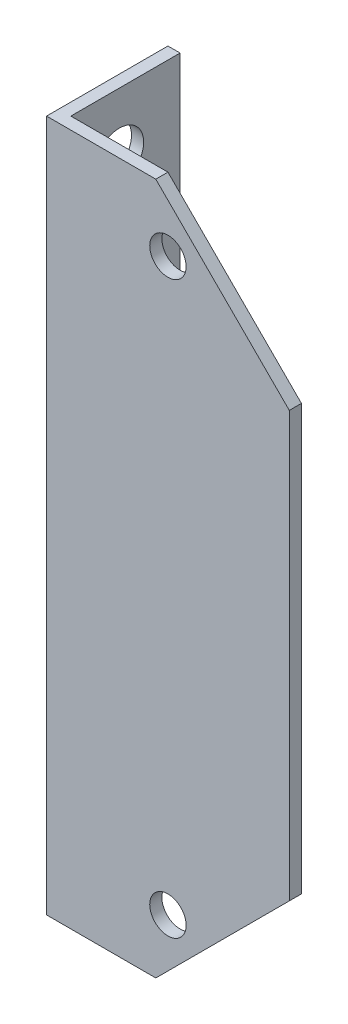
ISO-10303-21;
HEADER;
FILE_DESCRIPTION(('STEP AP214'),'2;1');
FILE_NAME('part.step','',(''),(''),'','','');
FILE_SCHEMA(('AUTOMOTIVE_DESIGN { 1 0 10303 214 1 1 1 1 }'));
ENDSEC;
DATA;
#1=APPLICATION_CONTEXT('core data for automotive mechanical design processes');
#2=APPLICATION_PROTOCOL_DEFINITION('international standard','automotive_design',2000,#1);
#3=PRODUCT_CONTEXT('',#1,'mechanical');
#4=PRODUCT('Part','Part','',(#3));
#5=PRODUCT_RELATED_PRODUCT_CATEGORY('part','',(#4));
#6=PRODUCT_DEFINITION_FORMATION('','',#4);
#7=PRODUCT_DEFINITION_CONTEXT('part definition',#1,'design');
#8=PRODUCT_DEFINITION('design','',#6,#7);
#9=PRODUCT_DEFINITION_SHAPE('','',#8);
#10=(LENGTH_UNIT() NAMED_UNIT(*) SI_UNIT(.MILLI.,.METRE.));
#11=(NAMED_UNIT(*) PLANE_ANGLE_UNIT() SI_UNIT($,.RADIAN.));
#12=(NAMED_UNIT(*) SI_UNIT($,.STERADIAN.) SOLID_ANGLE_UNIT());
#13=UNCERTAINTY_MEASURE_WITH_UNIT(LENGTH_MEASURE(1.E-05),#10,'distance_accuracy_value','');
#14=(GEOMETRIC_REPRESENTATION_CONTEXT(3) GLOBAL_UNCERTAINTY_ASSIGNED_CONTEXT((#13)) GLOBAL_UNIT_ASSIGNED_CONTEXT((#10,
#11,#12)) REPRESENTATION_CONTEXT('',''));
#15=CARTESIAN_POINT('',(0.,0.,0.));
#16=DIRECTION('',(0.,0.,1.));
#17=DIRECTION('',(1.,0.,0.));
#18=AXIS2_PLACEMENT_3D('',#15,#16,#17);
#19=CARTESIAN_POINT('',(-10.,57.,-8.5));
#20=DIRECTION('',(0.,0.,1.));
#21=DIRECTION('',(1.,0.,0.));
#22=AXIS2_PLACEMENT_3D('',#19,#20,#21);
#23=PLANE('',#22);
#24=DIRECTION('',(-1.,0.,0.));
#25=VECTOR('',#24,1.);
#26=CARTESIAN_POINT('',(-10.,0.,-8.5));
#27=LINE('',#26,#25);
#28=CARTESIAN_POINT('',(-10.,0.,-8.5));
#29=VERTEX_POINT('',#28);
#30=CARTESIAN_POINT('',(-11.,0.,-8.5));
#31=VERTEX_POINT('',#30);
#32=EDGE_CURVE('E141',#29,#31,#27,.T.);
#33=ORIENTED_EDGE('',*,*,#32,.T.);
#34=DIRECTION('',(0.,-1.,0.));
#35=VECTOR('',#34,1.);
#36=CARTESIAN_POINT('',(-11.,57.,-8.5));
#37=LINE('',#36,#35);
#38=CARTESIAN_POINT('',(-11.,57.,-8.5));
#39=VERTEX_POINT('',#38);
#40=EDGE_CURVE('E135',#39,#31,#37,.T.);
#41=ORIENTED_EDGE('',*,*,#40,.F.);
#42=DIRECTION('',(-1.,0.,0.));
#43=VECTOR('',#42,1.);
#44=CARTESIAN_POINT('',(-10.,57.,-8.5));
#45=LINE('',#44,#43);
#46=CARTESIAN_POINT('',(-10.,57.,-8.5));
#47=VERTEX_POINT('',#46);
#48=EDGE_CURVE('E116',#47,#39,#45,.T.);
#49=ORIENTED_EDGE('',*,*,#48,.F.);
#50=DIRECTION('',(0.,-1.,0.));
#51=VECTOR('',#50,1.);
#52=CARTESIAN_POINT('',(-10.,57.,-8.5));
#53=LINE('',#52,#51);
#54=EDGE_CURVE('E122',#47,#29,#53,.T.);
#55=ORIENTED_EDGE('',*,*,#54,.T.);
#56=EDGE_LOOP('',(#33,#41,#49,#55));
#57=FACE_BOUND('',#56,.T.);
#58=ADVANCED_FACE('F32',(#57),#23,.F.);
#59=CARTESIAN_POINT('',(-11.,57.,-8.5));
#60=DIRECTION('',(1.,0.,0.));
#61=DIRECTION('',(0.,0.,-1.));
#62=AXIS2_PLACEMENT_3D('',#59,#60,#61);
#63=PLANE('',#62);
#64=CARTESIAN_POINT('',(-11.,5.,-3.5));
#65=DIRECTION('',(-1.,0.,0.));
#66=DIRECTION('',(0.,0.,1.));
#67=AXIS2_PLACEMENT_3D('',#64,#65,#66);
#68=CIRCLE('',#67,2.);
#69=CARTESIAN_POINT('',(-11.,5.,-1.5));
#70=VERTEX_POINT('',#69);
#71=EDGE_CURVE('E145',#70,#70,#68,.T.);
#72=ORIENTED_EDGE('',*,*,#71,.F.);
#73=EDGE_LOOP('',(#72));
#74=FACE_BOUND('',#73,.T.);
#75=CARTESIAN_POINT('',(-11.,52.14,-3.5));
#76=DIRECTION('',(-1.,0.,0.));
#77=DIRECTION('',(0.,0.,1.));
#78=AXIS2_PLACEMENT_3D('',#75,#76,#77);
#79=CIRCLE('',#78,2.);
#80=CARTESIAN_POINT('',(-11.,52.14,-1.5));
#81=VERTEX_POINT('',#80);
#82=EDGE_CURVE('E142',#81,#81,#79,.T.);
#83=ORIENTED_EDGE('',*,*,#82,.F.);
#84=EDGE_LOOP('',(#83));
#85=FACE_BOUND('',#84,.T.);
#86=DIRECTION('',(0.,0.,1.));
#87=VECTOR('',#86,1.);
#88=CARTESIAN_POINT('',(-11.,0.,-8.5));
#89=LINE('',#88,#87);
#90=CARTESIAN_POINT('',(-11.,0.,1.5));
#91=VERTEX_POINT('',#90);
#92=EDGE_CURVE('E118',#31,#91,#89,.T.);
#93=ORIENTED_EDGE('',*,*,#92,.T.);
#94=DIRECTION('',(0.,-1.,0.));
#95=VECTOR('',#94,1.);
#96=CARTESIAN_POINT('',(-11.,57.,1.5));
#97=LINE('',#96,#95);
#98=CARTESIAN_POINT('',(-11.,57.,1.5));
#99=VERTEX_POINT('',#98);
#100=EDGE_CURVE('E132',#99,#91,#97,.T.);
#101=ORIENTED_EDGE('',*,*,#100,.F.);
#102=DIRECTION('',(0.,0.,1.));
#103=VECTOR('',#102,1.);
#104=CARTESIAN_POINT('',(-11.,57.,-8.5));
#105=LINE('',#104,#103);
#106=EDGE_CURVE('E163',#39,#99,#105,.T.);
#107=ORIENTED_EDGE('',*,*,#106,.F.);
#108=ORIENTED_EDGE('',*,*,#40,.T.);
#109=EDGE_LOOP('',(#93,#101,#107,#108));
#110=FACE_BOUND('',#109,.T.);
#111=ADVANCED_FACE('F174',(#74,#85,#110),#63,.F.);
#112=CARTESIAN_POINT('',(-11.,57.,1.5));
#113=DIRECTION('',(0.,0.,-1.));
#114=DIRECTION('',(-1.,0.,0.));
#115=AXIS2_PLACEMENT_3D('',#112,#113,#114);
#116=PLANE('',#115);
#117=CARTESIAN_POINT('',(-0.999999999999996,5.,1.49999999999999));
#118=DIRECTION('',(0.,0.,-1.));
#119=DIRECTION('',(-1.,0.,0.));
#120=AXIS2_PLACEMENT_3D('',#117,#118,#119);
#121=CIRCLE('',#120,1.5);
#122=CARTESIAN_POINT('',(-2.5,5.,1.49999999999999));
#123=VERTEX_POINT('',#122);
#124=EDGE_CURVE('E184',#123,#123,#121,.T.);
#125=ORIENTED_EDGE('',*,*,#124,.T.);
#126=EDGE_LOOP('',(#125));
#127=FACE_BOUND('',#126,.T.);
#128=CARTESIAN_POINT('',(-0.999999999999996,52.,1.49999999999999));
#129=DIRECTION('',(0.,0.,-1.));
#130=DIRECTION('',(-1.,0.,0.));
#131=AXIS2_PLACEMENT_3D('',#128,#129,#130);
#132=CIRCLE('',#131,1.5);
#133=CARTESIAN_POINT('',(-2.5,52.,1.49999999999999));
#134=VERTEX_POINT('',#133);
#135=EDGE_CURVE('E190',#134,#134,#132,.T.);
#136=ORIENTED_EDGE('',*,*,#135,.T.);
#137=EDGE_LOOP('',(#136));
#138=FACE_BOUND('',#137,.T.);
#139=DIRECTION('',(1.,0.,0.));
#140=VECTOR('',#139,1.);
#141=CARTESIAN_POINT('',(-11.,0.,1.5));
#142=LINE('',#141,#140);
#143=CARTESIAN_POINT('',(-2.,0.,1.5));
#144=VERTEX_POINT('',#143);
#145=EDGE_CURVE('E114',#91,#144,#142,.T.);
#146=ORIENTED_EDGE('',*,*,#145,.T.);
#147=DIRECTION('',(0.707106781186548,0.707106781186547,0.));
#148=VECTOR('',#147,1.);
#149=CARTESIAN_POINT('',(22.,24.,1.5));
#150=LINE('',#149,#148);
#151=CARTESIAN_POINT('',(9.00000000000001,11.,1.5));
#152=VERTEX_POINT('',#151);
#153=EDGE_CURVE('E46',#144,#152,#150,.T.);
#154=ORIENTED_EDGE('',*,*,#153,.T.);
#155=DIRECTION('',(0.,-1.,0.));
#156=VECTOR('',#155,1.);
#157=CARTESIAN_POINT('',(9.00000000000001,57.,1.5));
#158=LINE('',#157,#156);
#159=CARTESIAN_POINT('',(9.00000000000001,46.,1.5));
#160=VERTEX_POINT('',#159);
#161=EDGE_CURVE('E129',#160,#152,#158,.T.);
#162=ORIENTED_EDGE('',*,*,#161,.F.);
#163=DIRECTION('',(-0.707106781186547,0.707106781186548,0.));
#164=VECTOR('',#163,1.);
#165=CARTESIAN_POINT('',(-6.49999999999999,61.5,1.5));
#166=LINE('',#165,#164);
#167=CARTESIAN_POINT('',(-1.99999999999999,57.,1.5));
#168=VERTEX_POINT('',#167);
#169=EDGE_CURVE('E148',#160,#168,#166,.T.);
#170=ORIENTED_EDGE('',*,*,#169,.T.);
#171=DIRECTION('',(1.,0.,0.));
#172=VECTOR('',#171,1.);
#173=CARTESIAN_POINT('',(-11.,57.,1.5));
#174=LINE('',#173,#172);
#175=EDGE_CURVE('E157',#99,#168,#174,.T.);
#176=ORIENTED_EDGE('',*,*,#175,.F.);
#177=ORIENTED_EDGE('',*,*,#100,.T.);
#178=EDGE_LOOP('',(#146,#154,#162,#170,#176,#177));
#179=FACE_BOUND('',#178,.T.);
#180=ADVANCED_FACE('F156',(#127,#138,#179),#116,.F.);
#181=CARTESIAN_POINT('',(9.00000000000001,57.,1.5));
#182=DIRECTION('',(-1.,0.,0.));
#183=DIRECTION('',(0.,0.,1.));
#184=AXIS2_PLACEMENT_3D('',#181,#182,#183);
#185=PLANE('',#184);
#186=ORIENTED_EDGE('',*,*,#161,.T.);
#187=DIRECTION('',(0.,0.,-1.));
#188=VECTOR('',#187,1.);
#189=CARTESIAN_POINT('',(9.00000000000001,11.,50.5));
#190=LINE('',#189,#188);
#191=CARTESIAN_POINT('',(9.00000000000001,11.,0.499999999999999));
#192=VERTEX_POINT('',#191);
#193=EDGE_CURVE('E108',#152,#192,#190,.T.);
#194=ORIENTED_EDGE('',*,*,#193,.T.);
#195=DIRECTION('',(0.,-1.,0.));
#196=VECTOR('',#195,1.);
#197=CARTESIAN_POINT('',(9.00000000000001,57.,0.499999999999999));
#198=LINE('',#197,#196);
#199=CARTESIAN_POINT('',(9.00000000000001,46.,0.499999999999999));
#200=VERTEX_POINT('',#199);
#201=EDGE_CURVE('E107',#200,#192,#198,.T.);
#202=ORIENTED_EDGE('',*,*,#201,.F.);
#203=DIRECTION('',(0.,0.,-1.));
#204=VECTOR('',#203,1.);
#205=CARTESIAN_POINT('',(9.00000000000001,46.,50.5));
#206=LINE('',#205,#204);
#207=EDGE_CURVE('E159',#160,#200,#206,.T.);
#208=ORIENTED_EDGE('',*,*,#207,.F.);
#209=EDGE_LOOP('',(#186,#194,#202,#208));
#210=FACE_BOUND('',#209,.T.);
#211=ADVANCED_FACE('F178',(#210),#185,.F.);
#212=CARTESIAN_POINT('',(9.00000000000001,57.,0.499999999999999));
#213=DIRECTION('',(0.,0.,1.));
#214=DIRECTION('',(1.,0.,0.));
#215=AXIS2_PLACEMENT_3D('',#212,#213,#214);
#216=PLANE('',#215);
#217=CARTESIAN_POINT('',(-0.999999999999996,5.,0.5));
#218=DIRECTION('',(0.,0.,-1.));
#219=DIRECTION('',(-1.,0.,0.));
#220=AXIS2_PLACEMENT_3D('',#217,#218,#219);
#221=CIRCLE('',#220,1.5);
#222=CARTESIAN_POINT('',(-2.5,5.,0.5));
#223=VERTEX_POINT('',#222);
#224=EDGE_CURVE('E158',#223,#223,#221,.T.);
#225=ORIENTED_EDGE('',*,*,#224,.F.);
#226=EDGE_LOOP('',(#225));
#227=FACE_BOUND('',#226,.T.);
#228=CARTESIAN_POINT('',(-0.999999999999996,52.,0.5));
#229=DIRECTION('',(0.,0.,-1.));
#230=DIRECTION('',(-1.,0.,0.));
#231=AXIS2_PLACEMENT_3D('',#228,#229,#230);
#232=CIRCLE('',#231,1.5);
#233=CARTESIAN_POINT('',(-2.5,52.,0.5));
#234=VERTEX_POINT('',#233);
#235=EDGE_CURVE('E187',#234,#234,#232,.T.);
#236=ORIENTED_EDGE('',*,*,#235,.F.);
#237=EDGE_LOOP('',(#236));
#238=FACE_BOUND('',#237,.T.);
#239=ORIENTED_EDGE('',*,*,#201,.T.);
#240=DIRECTION('',(0.707106781186548,0.707106781186547,0.));
#241=VECTOR('',#240,1.);
#242=CARTESIAN_POINT('',(9.00000000000001,11.,0.499999999999999));
#243=LINE('',#242,#241);
#244=CARTESIAN_POINT('',(-1.99999999999999,0.,0.5));
#245=VERTEX_POINT('',#244);
#246=EDGE_CURVE('E94',#245,#192,#243,.T.);
#247=ORIENTED_EDGE('',*,*,#246,.F.);
#248=DIRECTION('',(-1.,0.,0.));
#249=VECTOR('',#248,1.);
#250=CARTESIAN_POINT('',(9.00000000000001,0.,0.499999999999999));
#251=LINE('',#250,#249);
#252=CARTESIAN_POINT('',(-10.,0.,0.500000000000001));
#253=VERTEX_POINT('',#252);
#254=EDGE_CURVE('E104',#245,#253,#251,.T.);
#255=ORIENTED_EDGE('',*,*,#254,.T.);
#256=DIRECTION('',(0.,-1.,0.));
#257=VECTOR('',#256,1.);
#258=CARTESIAN_POINT('',(-10.,57.,0.500000000000001));
#259=LINE('',#258,#257);
#260=CARTESIAN_POINT('',(-10.,57.,0.500000000000001));
#261=VERTEX_POINT('',#260);
#262=EDGE_CURVE('E125',#261,#253,#259,.T.);
#263=ORIENTED_EDGE('',*,*,#262,.F.);
#264=DIRECTION('',(-1.,0.,0.));
#265=VECTOR('',#264,1.);
#266=CARTESIAN_POINT('',(9.00000000000001,57.,0.499999999999999));
#267=LINE('',#266,#265);
#268=CARTESIAN_POINT('',(-1.99999999999999,57.,0.5));
#269=VERTEX_POINT('',#268);
#270=EDGE_CURVE('E165',#269,#261,#267,.T.);
#271=ORIENTED_EDGE('',*,*,#270,.F.);
#272=DIRECTION('',(-0.707106781186547,0.707106781186548,0.));
#273=VECTOR('',#272,1.);
#274=CARTESIAN_POINT('',(-1.99999999999999,57.,0.5));
#275=LINE('',#274,#273);
#276=EDGE_CURVE('E53',#200,#269,#275,.T.);
#277=ORIENTED_EDGE('',*,*,#276,.F.);
#278=EDGE_LOOP('',(#239,#247,#255,#263,#271,#277));
#279=FACE_BOUND('',#278,.T.);
#280=ADVANCED_FACE('F102',(#227,#238,#279),#216,.F.);
#281=CARTESIAN_POINT('',(-10.,57.,0.500000000000001));
#282=DIRECTION('',(-1.,0.,0.));
#283=DIRECTION('',(0.,0.,1.));
#284=AXIS2_PLACEMENT_3D('',#281,#282,#283);
#285=PLANE('',#284);
#286=CARTESIAN_POINT('',(-9.99999999999999,5.,-3.5));
#287=DIRECTION('',(-1.,0.,0.));
#288=DIRECTION('',(0.,0.,1.));
#289=AXIS2_PLACEMENT_3D('',#286,#287,#288);
#290=CIRCLE('',#289,2.);
#291=CARTESIAN_POINT('',(-9.99999999999999,5.,-1.5));
#292=VERTEX_POINT('',#291);
#293=EDGE_CURVE('E143',#292,#292,#290,.T.);
#294=ORIENTED_EDGE('',*,*,#293,.T.);
#295=EDGE_LOOP('',(#294));
#296=FACE_BOUND('',#295,.T.);
#297=CARTESIAN_POINT('',(-9.99999999999999,52.14,-3.5));
#298=DIRECTION('',(-1.,0.,0.));
#299=DIRECTION('',(0.,0.,1.));
#300=AXIS2_PLACEMENT_3D('',#297,#298,#299);
#301=CIRCLE('',#300,2.);
#302=CARTESIAN_POINT('',(-9.99999999999999,52.14,-1.5));
#303=VERTEX_POINT('',#302);
#304=EDGE_CURVE('E138',#303,#303,#301,.T.);
#305=ORIENTED_EDGE('',*,*,#304,.T.);
#306=EDGE_LOOP('',(#305));
#307=FACE_BOUND('',#306,.T.);
#308=DIRECTION('',(0.,0.,-1.));
#309=VECTOR('',#308,1.);
#310=CARTESIAN_POINT('',(-10.,0.,0.500000000000001));
#311=LINE('',#310,#309);
#312=EDGE_CURVE('E113',#253,#29,#311,.T.);
#313=ORIENTED_EDGE('',*,*,#312,.T.);
#314=ORIENTED_EDGE('',*,*,#54,.F.);
#315=DIRECTION('',(0.,0.,-1.));
#316=VECTOR('',#315,1.);
#317=CARTESIAN_POINT('',(-10.,57.,0.500000000000001));
#318=LINE('',#317,#316);
#319=EDGE_CURVE('E126',#261,#47,#318,.T.);
#320=ORIENTED_EDGE('',*,*,#319,.F.);
#321=ORIENTED_EDGE('',*,*,#262,.T.);
#322=EDGE_LOOP('',(#313,#314,#320,#321));
#323=FACE_BOUND('',#322,.T.);
#324=ADVANCED_FACE('F201',(#296,#307,#323),#285,.F.);
#325=CARTESIAN_POINT('',(0.,57.,0.));
#326=DIRECTION('',(0.,1.,0.));
#327=DIRECTION('',(0.,0.,1.));
#328=AXIS2_PLACEMENT_3D('',#325,#326,#327);
#329=PLANE('',#328);
#330=DIRECTION('',(0.,0.,1.));
#331=VECTOR('',#330,1.);
#332=CARTESIAN_POINT('',(-2.,57.,0.));
#333=LINE('',#332,#331);
#334=EDGE_CURVE('E39',#269,#168,#333,.T.);
#335=ORIENTED_EDGE('',*,*,#334,.F.);
#336=ORIENTED_EDGE('',*,*,#270,.T.);
#337=ORIENTED_EDGE('',*,*,#319,.T.);
#338=ORIENTED_EDGE('',*,*,#48,.T.);
#339=ORIENTED_EDGE('',*,*,#106,.T.);
#340=ORIENTED_EDGE('',*,*,#175,.T.);
#341=EDGE_LOOP('',(#335,#336,#337,#338,#339,#340));
#342=FACE_BOUND('',#341,.T.);
#343=ADVANCED_FACE('F161',(#342),#329,.T.);
#344=CARTESIAN_POINT('',(0.,0.,0.));
#345=DIRECTION('',(0.,1.,0.));
#346=DIRECTION('',(0.,0.,1.));
#347=AXIS2_PLACEMENT_3D('',#344,#345,#346);
#348=PLANE('',#347);
#349=ORIENTED_EDGE('',*,*,#254,.F.);
#350=DIRECTION('',(0.,0.,1.));
#351=VECTOR('',#350,1.);
#352=CARTESIAN_POINT('',(-2.,0.,0.));
#353=LINE('',#352,#351);
#354=EDGE_CURVE('E11',#245,#144,#353,.T.);
#355=ORIENTED_EDGE('',*,*,#354,.T.);
#356=ORIENTED_EDGE('',*,*,#145,.F.);
#357=ORIENTED_EDGE('',*,*,#92,.F.);
#358=ORIENTED_EDGE('',*,*,#32,.F.);
#359=ORIENTED_EDGE('',*,*,#312,.F.);
#360=EDGE_LOOP('',(#349,#355,#356,#357,#358,#359));
#361=FACE_BOUND('',#360,.T.);
#362=ADVANCED_FACE('F111',(#361),#348,.F.);
#363=CARTESIAN_POINT('',(39.,52.14,-3.50000000000002));
#364=DIRECTION('',(-1.,0.,0.));
#365=DIRECTION('',(0.,0.,1.));
#366=AXIS2_PLACEMENT_3D('',#363,#364,#365);
#367=CYLINDRICAL_SURFACE('',#366,2.);
#368=ORIENTED_EDGE('',*,*,#82,.T.);
#369=EDGE_LOOP('',(#368));
#370=FACE_BOUND('',#369,.T.);
#371=ORIENTED_EDGE('',*,*,#304,.F.);
#372=EDGE_LOOP('',(#371));
#373=FACE_BOUND('',#372,.T.);
#374=ADVANCED_FACE('F252',(#370,#373),#367,.F.);
#375=CARTESIAN_POINT('',(39.,5.,-3.50000000000002));
#376=DIRECTION('',(-1.,0.,0.));
#377=DIRECTION('',(0.,0.,1.));
#378=AXIS2_PLACEMENT_3D('',#375,#376,#377);
#379=CYLINDRICAL_SURFACE('',#378,2.);
#380=ORIENTED_EDGE('',*,*,#71,.T.);
#381=EDGE_LOOP('',(#380));
#382=FACE_BOUND('',#381,.T.);
#383=ORIENTED_EDGE('',*,*,#293,.F.);
#384=EDGE_LOOP('',(#383));
#385=FACE_BOUND('',#384,.T.);
#386=ADVANCED_FACE('F264',(#382,#385),#379,.F.);
#387=CARTESIAN_POINT('',(-0.999999999999989,52.,50.5));
#388=DIRECTION('',(0.,0.,-1.));
#389=DIRECTION('',(-1.,0.,0.));
#390=AXIS2_PLACEMENT_3D('',#387,#388,#389);
#391=CYLINDRICAL_SURFACE('',#390,1.5);
#392=ORIENTED_EDGE('',*,*,#235,.T.);
#393=EDGE_LOOP('',(#392));
#394=FACE_BOUND('',#393,.T.);
#395=ORIENTED_EDGE('',*,*,#135,.F.);
#396=EDGE_LOOP('',(#395));
#397=FACE_BOUND('',#396,.T.);
#398=ADVANCED_FACE('F258',(#394,#397),#391,.F.);
#399=CARTESIAN_POINT('',(-0.999999999999989,5.,50.5));
#400=DIRECTION('',(0.,0.,-1.));
#401=DIRECTION('',(-1.,0.,0.));
#402=AXIS2_PLACEMENT_3D('',#399,#400,#401);
#403=CYLINDRICAL_SURFACE('',#402,1.5);
#404=ORIENTED_EDGE('',*,*,#224,.T.);
#405=EDGE_LOOP('',(#404));
#406=FACE_BOUND('',#405,.T.);
#407=ORIENTED_EDGE('',*,*,#124,.F.);
#408=EDGE_LOOP('',(#407));
#409=FACE_BOUND('',#408,.T.);
#410=ADVANCED_FACE('F263',(#406,#409),#403,.F.);
#411=CARTESIAN_POINT('',(-1.99999999999999,57.,50.5));
#412=DIRECTION('',(-0.707106781186548,-0.707106781186547,0.));
#413=DIRECTION('',(0.707106781186547,-0.707106781186548,0.));
#414=AXIS2_PLACEMENT_3D('',#411,#412,#413);
#415=PLANE('',#414);
#416=ORIENTED_EDGE('',*,*,#207,.T.);
#417=ORIENTED_EDGE('',*,*,#276,.T.);
#418=ORIENTED_EDGE('',*,*,#334,.T.);
#419=ORIENTED_EDGE('',*,*,#169,.F.);
#420=EDGE_LOOP('',(#416,#417,#418,#419));
#421=FACE_BOUND('',#420,.T.);
#422=ADVANCED_FACE('F147',(#421),#415,.F.);
#423=CARTESIAN_POINT('',(9.00000000000001,11.,50.5));
#424=DIRECTION('',(-0.707106781186547,0.707106781186548,0.));
#425=DIRECTION('',(-0.707106781186548,-0.707106781186547,0.));
#426=AXIS2_PLACEMENT_3D('',#423,#424,#425);
#427=PLANE('',#426);
#428=ORIENTED_EDGE('',*,*,#354,.F.);
#429=ORIENTED_EDGE('',*,*,#246,.T.);
#430=ORIENTED_EDGE('',*,*,#193,.F.);
#431=ORIENTED_EDGE('',*,*,#153,.F.);
#432=EDGE_LOOP('',(#428,#429,#430,#431));
#433=FACE_BOUND('',#432,.T.);
#434=ADVANCED_FACE('F93',(#433),#427,.F.);
#435=CLOSED_SHELL('',(#58,#111,#180,#211,#280,#324,#343,#362,#374,#386,#398,#410,#422,#434));
#436=MANIFOLD_SOLID_BREP('B2',#435);
#437=ADVANCED_BREP_SHAPE_REPRESENTATION('',(#18,#436),#14);
#438=SHAPE_DEFINITION_REPRESENTATION(#9,#437);
ENDSEC;
END-ISO-10303-21;
